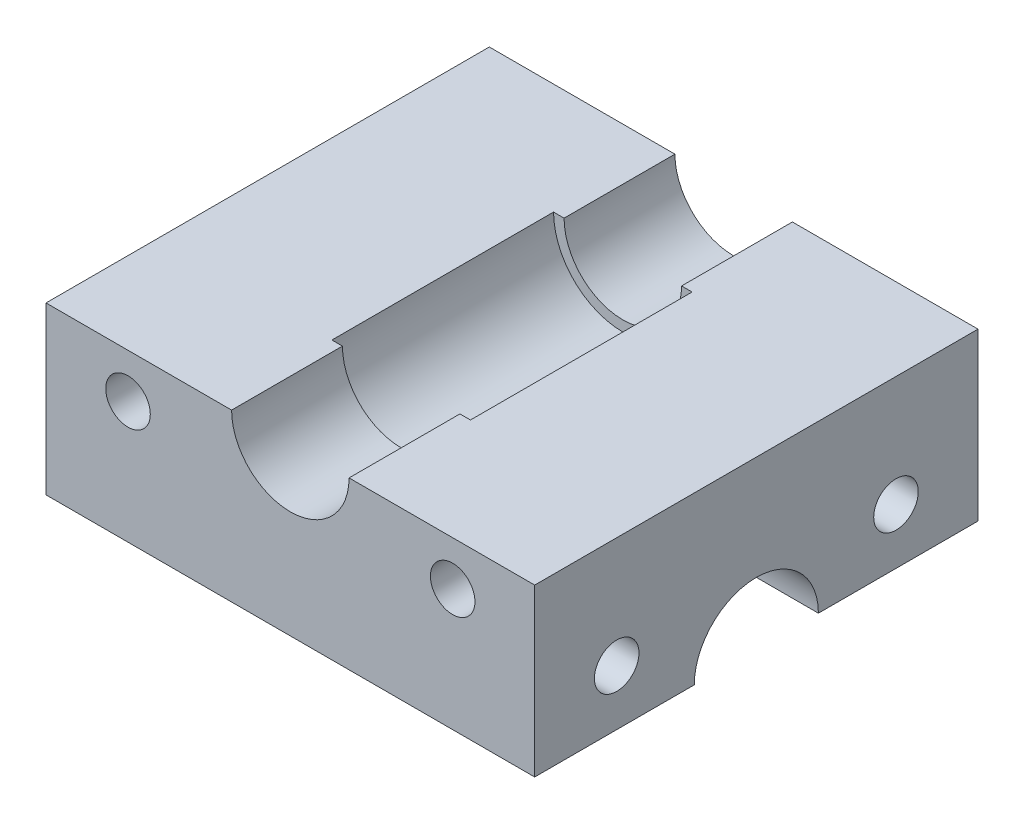
ISO-10303-21;
HEADER;
FILE_DESCRIPTION(('STEP AP214'),'2;1');
FILE_NAME('part.step','',(''),(''),'','','');
FILE_SCHEMA(('AUTOMOTIVE_DESIGN { 1 0 10303 214 1 1 1 1 }'));
ENDSEC;
DATA;
#1=APPLICATION_CONTEXT('core data for automotive mechanical design processes');
#2=APPLICATION_PROTOCOL_DEFINITION('international standard','automotive_design',2000,#1);
#3=PRODUCT_CONTEXT('',#1,'mechanical');
#4=PRODUCT('Part','Part','',(#3));
#5=PRODUCT_RELATED_PRODUCT_CATEGORY('part','',(#4));
#6=PRODUCT_DEFINITION_FORMATION('','',#4);
#7=PRODUCT_DEFINITION_CONTEXT('part definition',#1,'design');
#8=PRODUCT_DEFINITION('design','',#6,#7);
#9=PRODUCT_DEFINITION_SHAPE('','',#8);
#10=(LENGTH_UNIT() NAMED_UNIT(*) SI_UNIT(.MILLI.,.METRE.));
#11=(NAMED_UNIT(*) PLANE_ANGLE_UNIT() SI_UNIT($,.RADIAN.));
#12=(NAMED_UNIT(*) SI_UNIT($,.STERADIAN.) SOLID_ANGLE_UNIT());
#13=UNCERTAINTY_MEASURE_WITH_UNIT(LENGTH_MEASURE(1.E-05),#10,'distance_accuracy_value','');
#14=(GEOMETRIC_REPRESENTATION_CONTEXT(3) GLOBAL_UNCERTAINTY_ASSIGNED_CONTEXT((#13)) GLOBAL_UNIT_ASSIGNED_CONTEXT((#10,
#11,#12)) REPRESENTATION_CONTEXT('',''));
#15=CARTESIAN_POINT('',(0.,0.,0.));
#16=DIRECTION('',(0.,0.,1.));
#17=DIRECTION('',(1.,0.,0.));
#18=AXIS2_PLACEMENT_3D('',#15,#16,#17);
#19=CARTESIAN_POINT('',(-10.9940298507463,-2.47667711691045,50.8));
#20=DIRECTION('',(0.,1.,0.));
#21=DIRECTION('',(0.,0.,1.));
#22=AXIS2_PLACEMENT_3D('',#19,#20,#21);
#23=PLANE('',#22);
#24=DIRECTION('',(0.,0.,-1.));
#25=VECTOR('',#24,1.);
#26=CARTESIAN_POINT('',(-10.9940298507463,-2.47667711691045,50.8));
#27=LINE('',#26,#25);
#28=CARTESIAN_POINT('',(-10.9940298507463,-2.47667711691045,50.8));
#29=VERTEX_POINT('',#28);
#30=CARTESIAN_POINT('',(-10.9940298507463,-2.47667711691045,32.512));
#31=VERTEX_POINT('',#30);
#32=EDGE_CURVE('E135',#29,#31,#27,.T.);
#33=ORIENTED_EDGE('',*,*,#32,.T.);
#34=DIRECTION('',(1.,0.,0.));
#35=VECTOR('',#34,1.);
#36=CARTESIAN_POINT('',(-10.9940298507463,-2.47667711691045,32.512));
#37=LINE('',#36,#35);
#38=CARTESIAN_POINT('',(45.0059701492537,-2.47667711691045,32.512));
#39=VERTEX_POINT('',#38);
#40=EDGE_CURVE('E121',#31,#39,#37,.T.);
#41=ORIENTED_EDGE('',*,*,#40,.T.);
#42=DIRECTION('',(0.,0.,-1.));
#43=VECTOR('',#42,1.);
#44=CARTESIAN_POINT('',(45.0059701492537,-2.47667711691045,50.8));
#45=LINE('',#44,#43);
#46=CARTESIAN_POINT('',(45.0059701492537,-2.47667711691045,50.8));
#47=VERTEX_POINT('',#46);
#48=EDGE_CURVE('E145',#47,#39,#45,.T.);
#49=ORIENTED_EDGE('',*,*,#48,.F.);
#50=DIRECTION('',(1.,0.,0.));
#51=VECTOR('',#50,1.);
#52=CARTESIAN_POINT('',(-10.9940298507463,-2.47667711691045,50.8));
#53=LINE('',#52,#51);
#54=EDGE_CURVE('E139',#29,#47,#53,.T.);
#55=ORIENTED_EDGE('',*,*,#54,.F.);
#56=EDGE_LOOP('',(#33,#41,#49,#55));
#57=FACE_BOUND('',#56,.T.);
#58=ADVANCED_FACE('F35',(#57),#23,.F.);
#59=CARTESIAN_POINT('',(23.7369701492537,16.5733228830895,50.8));
#60=DIRECTION('',(0.,-1.,0.));
#61=DIRECTION('',(0.,0.,-1.));
#62=AXIS2_PLACEMENT_3D('',#59,#60,#61);
#63=PLANE('',#62);
#64=DIRECTION('',(-1.,0.,0.));
#65=VECTOR('',#64,1.);
#66=CARTESIAN_POINT('',(23.7369701492537,16.5733228830895,12.7));
#67=LINE('',#66,#65);
#68=CARTESIAN_POINT('',(24.9434701492537,16.5733228830895,12.7));
#69=VERTEX_POINT('',#68);
#70=CARTESIAN_POINT('',(23.7369701492537,16.5733228830895,12.7));
#71=VERTEX_POINT('',#70);
#72=EDGE_CURVE('E177',#69,#71,#67,.T.);
#73=ORIENTED_EDGE('',*,*,#72,.F.);
#74=DIRECTION('',(0.,0.,1.));
#75=VECTOR('',#74,1.);
#76=CARTESIAN_POINT('',(24.9434701492537,16.5733228830895,12.7));
#77=LINE('',#76,#75);
#78=CARTESIAN_POINT('',(24.9434701492537,16.5733228830895,38.1));
#79=VERTEX_POINT('',#78);
#80=EDGE_CURVE('E160',#69,#79,#77,.T.);
#81=ORIENTED_EDGE('',*,*,#80,.T.);
#82=DIRECTION('',(-1.,0.,0.));
#83=VECTOR('',#82,1.);
#84=CARTESIAN_POINT('',(23.7369701492537,16.5733228830895,38.1));
#85=LINE('',#84,#83);
#86=CARTESIAN_POINT('',(23.7369701492537,16.5733228830895,38.1));
#87=VERTEX_POINT('',#86);
#88=EDGE_CURVE('E166',#79,#87,#85,.T.);
#89=ORIENTED_EDGE('',*,*,#88,.T.);
#90=DIRECTION('',(0.,0.,-1.));
#91=VECTOR('',#90,1.);
#92=CARTESIAN_POINT('',(23.7369701492537,16.5733228830895,50.8));
#93=LINE('',#92,#91);
#94=CARTESIAN_POINT('',(23.7369701492537,16.5733228830895,50.8));
#95=VERTEX_POINT('',#94);
#96=EDGE_CURVE('E213',#95,#87,#93,.T.);
#97=ORIENTED_EDGE('',*,*,#96,.F.);
#98=DIRECTION('',(-1.,0.,0.));
#99=VECTOR('',#98,1.);
#100=CARTESIAN_POINT('',(23.7369701492537,16.5733228830895,50.8));
#101=LINE('',#100,#99);
#102=CARTESIAN_POINT('',(45.0059701492537,16.5733228830895,50.8));
#103=VERTEX_POINT('',#102);
#104=EDGE_CURVE('E187',#103,#95,#101,.T.);
#105=ORIENTED_EDGE('',*,*,#104,.F.);
#106=DIRECTION('',(0.,0.,-1.));
#107=VECTOR('',#106,1.);
#108=CARTESIAN_POINT('',(45.0059701492537,16.5733228830895,50.8));
#109=LINE('',#108,#107);
#110=CARTESIAN_POINT('',(45.0059701492537,16.5733228830895,0.));
#111=VERTEX_POINT('',#110);
#112=EDGE_CURVE('E215',#103,#111,#109,.T.);
#113=ORIENTED_EDGE('',*,*,#112,.T.);
#114=DIRECTION('',(-1.,0.,0.));
#115=VECTOR('',#114,1.);
#116=CARTESIAN_POINT('',(23.7369701492537,16.5733228830895,0.));
#117=LINE('',#116,#115);
#118=CARTESIAN_POINT('',(23.7369701492537,16.5733228830895,0.));
#119=VERTEX_POINT('',#118);
#120=EDGE_CURVE('E200',#111,#119,#117,.T.);
#121=ORIENTED_EDGE('',*,*,#120,.T.);
#122=EDGE_CURVE('E212',#71,#119,#93,.T.);
#123=ORIENTED_EDGE('',*,*,#122,.F.);
#124=EDGE_LOOP('',(#73,#81,#89,#97,#105,#113,#121,#123));
#125=FACE_BOUND('',#124,.T.);
#126=ADVANCED_FACE('F284',(#125),#63,.F.);
#127=CARTESIAN_POINT('',(17.0059701492537,16.5733228830895,50.8));
#128=DIRECTION('',(0.,0.,-1.));
#129=DIRECTION('',(-1.,0.,0.));
#130=AXIS2_PLACEMENT_3D('',#127,#128,#129);
#131=CYLINDRICAL_SURFACE('',#130,6.731);
#132=CARTESIAN_POINT('',(17.0059701492537,16.5733228830895,12.7));
#133=DIRECTION('',(0.,0.,1.));
#134=DIRECTION('',(1.,0.,0.));
#135=AXIS2_PLACEMENT_3D('',#132,#133,#134);
#136=CIRCLE('',#135,6.731);
#137=CARTESIAN_POINT('',(10.2749701492537,16.5733228830895,12.7));
#138=VERTEX_POINT('',#137);
#139=EDGE_CURVE('E175',#71,#138,#136,.F.);
#140=ORIENTED_EDGE('',*,*,#139,.F.);
#141=ORIENTED_EDGE('',*,*,#122,.T.);
#142=CARTESIAN_POINT('',(17.0059701492537,16.5733228830895,0.));
#143=DIRECTION('',(0.,0.,-1.));
#144=DIRECTION('',(-1.,0.,0.));
#145=AXIS2_PLACEMENT_3D('',#142,#143,#144);
#146=CIRCLE('',#145,6.731);
#147=CARTESIAN_POINT('',(10.2749701492537,16.5733228830895,0.));
#148=VERTEX_POINT('',#147);
#149=EDGE_CURVE('E203',#119,#148,#146,.T.);
#150=ORIENTED_EDGE('',*,*,#149,.T.);
#151=DIRECTION('',(0.,0.,-1.));
#152=VECTOR('',#151,1.);
#153=CARTESIAN_POINT('',(10.2749701492537,16.5733228830895,50.8));
#154=LINE('',#153,#152);
#155=EDGE_CURVE('E209',#138,#148,#154,.T.);
#156=ORIENTED_EDGE('',*,*,#155,.F.);
#157=EDGE_LOOP('',(#140,#141,#150,#156));
#158=FACE_BOUND('',#157,.T.);
#159=ADVANCED_FACE('F288',(#158),#131,.F.);
#160=CARTESIAN_POINT('',(-10.9940298507463,16.5733228830895,50.8));
#161=DIRECTION('',(0.,-1.,0.));
#162=DIRECTION('',(0.,0.,-1.));
#163=AXIS2_PLACEMENT_3D('',#160,#161,#162);
#164=PLANE('',#163);
#165=DIRECTION('',(-1.,0.,0.));
#166=VECTOR('',#165,1.);
#167=CARTESIAN_POINT('',(-10.9940298507463,16.5733228830895,12.7));
#168=LINE('',#167,#166);
#169=CARTESIAN_POINT('',(9.06847014925373,16.5733228830895,12.7));
#170=VERTEX_POINT('',#169);
#171=EDGE_CURVE('E11',#138,#170,#168,.T.);
#172=ORIENTED_EDGE('',*,*,#171,.F.);
#173=ORIENTED_EDGE('',*,*,#155,.T.);
#174=DIRECTION('',(-1.,0.,0.));
#175=VECTOR('',#174,1.);
#176=CARTESIAN_POINT('',(-10.9940298507463,16.5733228830895,0.));
#177=LINE('',#176,#175);
#178=CARTESIAN_POINT('',(-10.9940298507463,16.5733228830895,0.));
#179=VERTEX_POINT('',#178);
#180=EDGE_CURVE('E183',#148,#179,#177,.T.);
#181=ORIENTED_EDGE('',*,*,#180,.T.);
#182=DIRECTION('',(0.,0.,-1.));
#183=VECTOR('',#182,1.);
#184=CARTESIAN_POINT('',(-10.9940298507463,16.5733228830895,50.8));
#185=LINE('',#184,#183);
#186=CARTESIAN_POINT('',(-10.9940298507463,16.5733228830895,50.8));
#187=VERTEX_POINT('',#186);
#188=EDGE_CURVE('E193',#187,#179,#185,.T.);
#189=ORIENTED_EDGE('',*,*,#188,.F.);
#190=DIRECTION('',(-1.,0.,0.));
#191=VECTOR('',#190,1.);
#192=CARTESIAN_POINT('',(-10.9940298507463,16.5733228830895,50.8));
#193=LINE('',#192,#191);
#194=CARTESIAN_POINT('',(10.2749701492537,16.5733228830895,50.8));
#195=VERTEX_POINT('',#194);
#196=EDGE_CURVE('E191',#195,#187,#193,.T.);
#197=ORIENTED_EDGE('',*,*,#196,.F.);
#198=CARTESIAN_POINT('',(10.2749701492537,16.5733228830895,38.1));
#199=VERTEX_POINT('',#198);
#200=EDGE_CURVE('E210',#195,#199,#154,.T.);
#201=ORIENTED_EDGE('',*,*,#200,.T.);
#202=DIRECTION('',(-1.,0.,0.));
#203=VECTOR('',#202,1.);
#204=CARTESIAN_POINT('',(-10.9940298507463,16.5733228830895,38.1));
#205=LINE('',#204,#203);
#206=CARTESIAN_POINT('',(9.06847014925374,16.5733228830895,38.1));
#207=VERTEX_POINT('',#206);
#208=EDGE_CURVE('E141',#199,#207,#205,.T.);
#209=ORIENTED_EDGE('',*,*,#208,.T.);
#210=DIRECTION('',(0.,0.,1.));
#211=VECTOR('',#210,1.);
#212=CARTESIAN_POINT('',(9.06847014925373,16.5733228830895,12.7));
#213=LINE('',#212,#211);
#214=EDGE_CURVE('E43',#207,#170,#213,.F.);
#215=ORIENTED_EDGE('',*,*,#214,.T.);
#216=EDGE_LOOP('',(#172,#173,#181,#189,#197,#201,#209,#215));
#217=FACE_BOUND('',#216,.T.);
#218=ADVANCED_FACE('F151',(#217),#164,.F.);
#219=CARTESIAN_POINT('',(-10.9940298507463,-2.47667711691045,50.8));
#220=DIRECTION('',(1.,0.,0.));
#221=DIRECTION('',(0.,0.,-1.));
#222=AXIS2_PLACEMENT_3D('',#219,#220,#221);
#223=PLANE('',#222);
#224=CARTESIAN_POINT('',(-10.9940298507463,3.87332288308955,41.402));
#225=DIRECTION('',(-1.,0.,0.));
#226=DIRECTION('',(0.,0.,1.));
#227=AXIS2_PLACEMENT_3D('',#224,#225,#226);
#228=CIRCLE('',#227,2.55269999999999);
#229=CARTESIAN_POINT('',(-10.9940298507463,3.87332288308955,43.9547));
#230=VERTEX_POINT('',#229);
#231=EDGE_CURVE('E240',#230,#230,#228,.T.);
#232=ORIENTED_EDGE('',*,*,#231,.F.);
#233=EDGE_LOOP('',(#232));
#234=FACE_BOUND('',#233,.T.);
#235=CARTESIAN_POINT('',(-10.9940298507463,3.87332288308955,9.398));
#236=DIRECTION('',(-1.,0.,0.));
#237=DIRECTION('',(0.,0.,1.));
#238=AXIS2_PLACEMENT_3D('',#235,#236,#237);
#239=CIRCLE('',#238,2.55269999999999);
#240=CARTESIAN_POINT('',(-10.9940298507463,3.87332288308955,11.9507));
#241=VERTEX_POINT('',#240);
#242=EDGE_CURVE('E260',#241,#241,#239,.T.);
#243=ORIENTED_EDGE('',*,*,#242,.F.);
#244=EDGE_LOOP('',(#243));
#245=FACE_BOUND('',#244,.T.);
#246=CARTESIAN_POINT('',(-10.9940298507463,-2.47667711691045,18.288));
#247=VERTEX_POINT('',#246);
#248=CARTESIAN_POINT('',(-10.9940298507463,-2.47667711691045,0.));
#249=VERTEX_POINT('',#248);
#250=EDGE_CURVE('E137',#247,#249,#27,.T.);
#251=ORIENTED_EDGE('',*,*,#250,.F.);
#252=CARTESIAN_POINT('',(-10.9940298507463,-2.47667711691045,25.4));
#253=DIRECTION('',(1.,0.,0.));
#254=DIRECTION('',(0.,0.,-1.));
#255=AXIS2_PLACEMENT_3D('',#252,#253,#254);
#256=CIRCLE('',#255,7.112);
#257=EDGE_CURVE('E124',#247,#31,#256,.T.);
#258=ORIENTED_EDGE('',*,*,#257,.T.);
#259=ORIENTED_EDGE('',*,*,#32,.F.);
#260=DIRECTION('',(0.,-1.,0.));
#261=VECTOR('',#260,1.);
#262=CARTESIAN_POINT('',(-10.9940298507463,-2.47667711691045,50.8));
#263=LINE('',#262,#261);
#264=EDGE_CURVE('E181',#187,#29,#263,.T.);
#265=ORIENTED_EDGE('',*,*,#264,.F.);
#266=ORIENTED_EDGE('',*,*,#188,.T.);
#267=DIRECTION('',(0.,-1.,0.));
#268=VECTOR('',#267,1.);
#269=CARTESIAN_POINT('',(-10.9940298507463,-2.47667711691045,0.));
#270=LINE('',#269,#268);
#271=EDGE_CURVE('E180',#179,#249,#270,.T.);
#272=ORIENTED_EDGE('',*,*,#271,.T.);
#273=EDGE_LOOP('',(#251,#258,#259,#265,#266,#272));
#274=FACE_BOUND('',#273,.T.);
#275=ADVANCED_FACE('F37',(#234,#245,#274),#223,.F.);
#276=CARTESIAN_POINT('',(45.0059701492537,-2.47667711691045,18.288));
#277=VERTEX_POINT('',#276);
#278=CARTESIAN_POINT('',(45.0059701492537,-2.47667711691045,0.));
#279=VERTEX_POINT('',#278);
#280=EDGE_CURVE('E217',#277,#279,#45,.T.);
#281=ORIENTED_EDGE('',*,*,#280,.F.);
#282=DIRECTION('',(1.,0.,0.));
#283=VECTOR('',#282,1.);
#284=CARTESIAN_POINT('',(-10.9940298507463,-2.47667711691045,18.288));
#285=LINE('',#284,#283);
#286=EDGE_CURVE('E50',#247,#277,#285,.T.);
#287=ORIENTED_EDGE('',*,*,#286,.F.);
#288=ORIENTED_EDGE('',*,*,#250,.T.);
#289=DIRECTION('',(1.,0.,0.));
#290=VECTOR('',#289,1.);
#291=CARTESIAN_POINT('',(-10.9940298507463,-2.47667711691045,0.));
#292=LINE('',#291,#290);
#293=EDGE_CURVE('E195',#249,#279,#292,.T.);
#294=ORIENTED_EDGE('',*,*,#293,.T.);
#295=EDGE_LOOP('',(#281,#287,#288,#294));
#296=FACE_BOUND('',#295,.T.);
#297=ADVANCED_FACE('F239',(#296),#23,.F.);
#298=CARTESIAN_POINT('',(45.0059701492537,-2.47667711691045,50.8));
#299=DIRECTION('',(-1.,0.,0.));
#300=DIRECTION('',(0.,0.,1.));
#301=AXIS2_PLACEMENT_3D('',#298,#299,#300);
#302=PLANE('',#301);
#303=CARTESIAN_POINT('',(45.0059701492537,3.87332288308955,41.402));
#304=DIRECTION('',(-1.,0.,0.));
#305=DIRECTION('',(0.,0.,1.));
#306=AXIS2_PLACEMENT_3D('',#303,#304,#305);
#307=CIRCLE('',#306,2.55269999999999);
#308=CARTESIAN_POINT('',(45.0059701492537,3.87332288308955,43.9547));
#309=VERTEX_POINT('',#308);
#310=EDGE_CURVE('E243',#309,#309,#307,.T.);
#311=ORIENTED_EDGE('',*,*,#310,.T.);
#312=EDGE_LOOP('',(#311));
#313=FACE_BOUND('',#312,.T.);
#314=CARTESIAN_POINT('',(45.0059701492537,3.87332288308955,9.398));
#315=DIRECTION('',(-1.,0.,0.));
#316=DIRECTION('',(0.,0.,1.));
#317=AXIS2_PLACEMENT_3D('',#314,#315,#316);
#318=CIRCLE('',#317,2.55269999999999);
#319=CARTESIAN_POINT('',(45.0059701492537,3.87332288308955,11.9507));
#320=VERTEX_POINT('',#319);
#321=EDGE_CURVE('E168',#320,#320,#318,.T.);
#322=ORIENTED_EDGE('',*,*,#321,.T.);
#323=EDGE_LOOP('',(#322));
#324=FACE_BOUND('',#323,.T.);
#325=ORIENTED_EDGE('',*,*,#48,.T.);
#326=CARTESIAN_POINT('',(45.0059701492537,-2.47667711691045,25.4));
#327=DIRECTION('',(1.,0.,0.));
#328=DIRECTION('',(0.,0.,-1.));
#329=AXIS2_PLACEMENT_3D('',#326,#327,#328);
#330=CIRCLE('',#329,7.112);
#331=EDGE_CURVE('E125',#277,#39,#330,.T.);
#332=ORIENTED_EDGE('',*,*,#331,.F.);
#333=ORIENTED_EDGE('',*,*,#280,.T.);
#334=DIRECTION('',(0.,1.,0.));
#335=VECTOR('',#334,1.);
#336=CARTESIAN_POINT('',(45.0059701492537,-2.47667711691045,0.));
#337=LINE('',#336,#335);
#338=EDGE_CURVE('E198',#279,#111,#337,.T.);
#339=ORIENTED_EDGE('',*,*,#338,.T.);
#340=ORIENTED_EDGE('',*,*,#112,.F.);
#341=DIRECTION('',(0.,1.,0.));
#342=VECTOR('',#341,1.);
#343=CARTESIAN_POINT('',(45.0059701492537,-2.47667711691045,50.8));
#344=LINE('',#343,#342);
#345=EDGE_CURVE('E185',#47,#103,#344,.T.);
#346=ORIENTED_EDGE('',*,*,#345,.F.);
#347=EDGE_LOOP('',(#325,#332,#333,#339,#340,#346));
#348=FACE_BOUND('',#347,.T.);
#349=ADVANCED_FACE('F225',(#313,#324,#348),#302,.F.);
#350=ORIENTED_EDGE('',*,*,#96,.T.);
#351=CARTESIAN_POINT('',(17.0059701492537,16.5733228830895,38.1));
#352=DIRECTION('',(0.,0.,1.));
#353=DIRECTION('',(1.,0.,0.));
#354=AXIS2_PLACEMENT_3D('',#351,#352,#353);
#355=CIRCLE('',#354,6.731);
#356=EDGE_CURVE('E163',#87,#199,#355,.F.);
#357=ORIENTED_EDGE('',*,*,#356,.T.);
#358=ORIENTED_EDGE('',*,*,#200,.F.);
#359=CARTESIAN_POINT('',(17.0059701492537,16.5733228830895,50.8));
#360=DIRECTION('',(0.,0.,-1.));
#361=DIRECTION('',(-1.,0.,0.));
#362=AXIS2_PLACEMENT_3D('',#359,#360,#361);
#363=CIRCLE('',#362,6.731);
#364=EDGE_CURVE('E189',#95,#195,#363,.T.);
#365=ORIENTED_EDGE('',*,*,#364,.F.);
#366=EDGE_LOOP('',(#350,#357,#358,#365));
#367=FACE_BOUND('',#366,.T.);
#368=ADVANCED_FACE('F296',(#367),#131,.F.);
#369=CARTESIAN_POINT('',(17.0059701492537,16.5733228830895,50.8));
#370=DIRECTION('',(0.,0.,-1.));
#371=DIRECTION('',(-1.,0.,0.));
#372=AXIS2_PLACEMENT_3D('',#369,#370,#371);
#373=PLANE('',#372);
#374=CARTESIAN_POINT('',(-1.59602985074627,11.4933228830896,50.8));
#375=DIRECTION('',(0.,0.,1.));
#376=DIRECTION('',(1.,0.,0.));
#377=AXIS2_PLACEMENT_3D('',#374,#375,#376);
#378=CIRCLE('',#377,2.55269999999999);
#379=CARTESIAN_POINT('',(0.95667014925372,11.4933228830896,50.8));
#380=VERTEX_POINT('',#379);
#381=EDGE_CURVE('E249',#380,#380,#378,.T.);
#382=ORIENTED_EDGE('',*,*,#381,.F.);
#383=EDGE_LOOP('',(#382));
#384=FACE_BOUND('',#383,.T.);
#385=CARTESIAN_POINT('',(35.6079701492537,11.4933228830896,50.8));
#386=DIRECTION('',(0.,0.,1.));
#387=DIRECTION('',(1.,0.,0.));
#388=AXIS2_PLACEMENT_3D('',#385,#386,#387);
#389=CIRCLE('',#388,2.55269999999999);
#390=CARTESIAN_POINT('',(38.1606701492537,11.4933228830896,50.8));
#391=VERTEX_POINT('',#390);
#392=EDGE_CURVE('E255',#391,#391,#389,.T.);
#393=ORIENTED_EDGE('',*,*,#392,.F.);
#394=EDGE_LOOP('',(#393));
#395=FACE_BOUND('',#394,.T.);
#396=ORIENTED_EDGE('',*,*,#264,.T.);
#397=ORIENTED_EDGE('',*,*,#54,.T.);
#398=ORIENTED_EDGE('',*,*,#345,.T.);
#399=ORIENTED_EDGE('',*,*,#104,.T.);
#400=ORIENTED_EDGE('',*,*,#364,.T.);
#401=ORIENTED_EDGE('',*,*,#196,.T.);
#402=EDGE_LOOP('',(#396,#397,#398,#399,#400,#401));
#403=FACE_BOUND('',#402,.T.);
#404=ADVANCED_FACE('F227',(#384,#395,#403),#373,.F.);
#405=CARTESIAN_POINT('',(17.0059701492537,16.5733228830895,0.));
#406=DIRECTION('',(0.,0.,-1.));
#407=DIRECTION('',(-1.,0.,0.));
#408=AXIS2_PLACEMENT_3D('',#405,#406,#407);
#409=PLANE('',#408);
#410=CARTESIAN_POINT('',(-1.59602985074627,11.4933228830896,0.));
#411=DIRECTION('',(0.,0.,1.));
#412=DIRECTION('',(1.,0.,0.));
#413=AXIS2_PLACEMENT_3D('',#410,#411,#412);
#414=CIRCLE('',#413,2.55269999999999);
#415=CARTESIAN_POINT('',(0.95667014925372,11.4933228830896,0.));
#416=VERTEX_POINT('',#415);
#417=EDGE_CURVE('E252',#416,#416,#414,.T.);
#418=ORIENTED_EDGE('',*,*,#417,.T.);
#419=EDGE_LOOP('',(#418));
#420=FACE_BOUND('',#419,.T.);
#421=CARTESIAN_POINT('',(35.6079701492537,11.4933228830896,0.));
#422=DIRECTION('',(0.,0.,1.));
#423=DIRECTION('',(1.,0.,0.));
#424=AXIS2_PLACEMENT_3D('',#421,#422,#423);
#425=CIRCLE('',#424,2.55269999999998);
#426=CARTESIAN_POINT('',(38.1606701492537,11.4933228830896,0.));
#427=VERTEX_POINT('',#426);
#428=EDGE_CURVE('E258',#427,#427,#425,.T.);
#429=ORIENTED_EDGE('',*,*,#428,.T.);
#430=EDGE_LOOP('',(#429));
#431=FACE_BOUND('',#430,.T.);
#432=ORIENTED_EDGE('',*,*,#271,.F.);
#433=ORIENTED_EDGE('',*,*,#180,.F.);
#434=ORIENTED_EDGE('',*,*,#149,.F.);
#435=ORIENTED_EDGE('',*,*,#120,.F.);
#436=ORIENTED_EDGE('',*,*,#338,.F.);
#437=ORIENTED_EDGE('',*,*,#293,.F.);
#438=EDGE_LOOP('',(#432,#433,#434,#435,#436,#437));
#439=FACE_BOUND('',#438,.T.);
#440=ADVANCED_FACE('F235',(#420,#431,#439),#409,.T.);
#441=CARTESIAN_POINT('',(17.0059701492537,16.5733228830895,12.7));
#442=DIRECTION('',(0.,0.,1.));
#443=DIRECTION('',(1.,0.,0.));
#444=AXIS2_PLACEMENT_3D('',#441,#442,#443);
#445=CYLINDRICAL_SURFACE('',#444,7.9375);
#446=CARTESIAN_POINT('',(17.0059701492537,16.5733228830895,12.7));
#447=DIRECTION('',(0.,0.,1.));
#448=DIRECTION('',(1.,0.,0.));
#449=AXIS2_PLACEMENT_3D('',#446,#447,#448);
#450=CIRCLE('',#449,7.9375);
#451=EDGE_CURVE('E159',#170,#69,#450,.T.);
#452=ORIENTED_EDGE('',*,*,#451,.F.);
#453=ORIENTED_EDGE('',*,*,#214,.F.);
#454=CARTESIAN_POINT('',(17.0059701492537,16.5733228830895,38.1));
#455=DIRECTION('',(0.,0.,1.));
#456=DIRECTION('',(1.,0.,0.));
#457=AXIS2_PLACEMENT_3D('',#454,#455,#456);
#458=CIRCLE('',#457,7.9375);
#459=EDGE_CURVE('E58',#207,#79,#458,.T.);
#460=ORIENTED_EDGE('',*,*,#459,.T.);
#461=ORIENTED_EDGE('',*,*,#80,.F.);
#462=EDGE_LOOP('',(#452,#453,#460,#461));
#463=FACE_BOUND('',#462,.T.);
#464=ADVANCED_FACE('F156',(#463),#445,.F.);
#465=CARTESIAN_POINT('',(17.0059701492537,16.5733228830895,12.7));
#466=DIRECTION('',(0.,0.,1.));
#467=DIRECTION('',(1.,0.,0.));
#468=AXIS2_PLACEMENT_3D('',#465,#466,#467);
#469=PLANE('',#468);
#470=ORIENTED_EDGE('',*,*,#72,.T.);
#471=ORIENTED_EDGE('',*,*,#139,.T.);
#472=ORIENTED_EDGE('',*,*,#171,.T.);
#473=ORIENTED_EDGE('',*,*,#451,.T.);
#474=EDGE_LOOP('',(#470,#471,#472,#473));
#475=FACE_BOUND('',#474,.T.);
#476=ADVANCED_FACE('F280',(#475),#469,.T.);
#477=CARTESIAN_POINT('',(17.0059701492537,16.5733228830895,38.1));
#478=DIRECTION('',(0.,0.,1.));
#479=DIRECTION('',(1.,0.,0.));
#480=AXIS2_PLACEMENT_3D('',#477,#478,#479);
#481=PLANE('',#480);
#482=ORIENTED_EDGE('',*,*,#459,.F.);
#483=ORIENTED_EDGE('',*,*,#208,.F.);
#484=ORIENTED_EDGE('',*,*,#356,.F.);
#485=ORIENTED_EDGE('',*,*,#88,.F.);
#486=EDGE_LOOP('',(#482,#483,#484,#485));
#487=FACE_BOUND('',#486,.T.);
#488=ADVANCED_FACE('F271',(#487),#481,.F.);
#489=CARTESIAN_POINT('',(-10.9940298507463,3.87332288308955,9.398));
#490=DIRECTION('',(-1.,0.,0.));
#491=DIRECTION('',(0.,0.,1.));
#492=AXIS2_PLACEMENT_3D('',#489,#490,#491);
#493=CYLINDRICAL_SURFACE('',#492,2.55269999999999);
#494=ORIENTED_EDGE('',*,*,#321,.F.);
#495=EDGE_LOOP('',(#494));
#496=FACE_BOUND('',#495,.T.);
#497=ORIENTED_EDGE('',*,*,#242,.T.);
#498=EDGE_LOOP('',(#497));
#499=FACE_BOUND('',#498,.T.);
#500=ADVANCED_FACE('F268',(#496,#499),#493,.F.);
#501=CARTESIAN_POINT('',(35.6079701492537,11.4933228830896,50.8));
#502=DIRECTION('',(0.,0.,1.));
#503=DIRECTION('',(1.,0.,0.));
#504=AXIS2_PLACEMENT_3D('',#501,#502,#503);
#505=CYLINDRICAL_SURFACE('',#504,2.55269999999999);
#506=ORIENTED_EDGE('',*,*,#428,.F.);
#507=EDGE_LOOP('',(#506));
#508=FACE_BOUND('',#507,.T.);
#509=ORIENTED_EDGE('',*,*,#392,.T.);
#510=EDGE_LOOP('',(#509));
#511=FACE_BOUND('',#510,.T.);
#512=ADVANCED_FACE('F270',(#508,#511),#505,.F.);
#513=CARTESIAN_POINT('',(-1.59602985074627,11.4933228830896,50.8));
#514=DIRECTION('',(0.,0.,1.));
#515=DIRECTION('',(1.,0.,0.));
#516=AXIS2_PLACEMENT_3D('',#513,#514,#515);
#517=CYLINDRICAL_SURFACE('',#516,2.55269999999999);
#518=ORIENTED_EDGE('',*,*,#417,.F.);
#519=EDGE_LOOP('',(#518));
#520=FACE_BOUND('',#519,.T.);
#521=ORIENTED_EDGE('',*,*,#381,.T.);
#522=EDGE_LOOP('',(#521));
#523=FACE_BOUND('',#522,.T.);
#524=ADVANCED_FACE('F277',(#520,#523),#517,.F.);
#525=CARTESIAN_POINT('',(-10.9940298507463,3.87332288308955,41.402));
#526=DIRECTION('',(-1.,0.,0.));
#527=DIRECTION('',(0.,0.,1.));
#528=AXIS2_PLACEMENT_3D('',#525,#526,#527);
#529=CYLINDRICAL_SURFACE('',#528,2.55269999999999);
#530=ORIENTED_EDGE('',*,*,#310,.F.);
#531=EDGE_LOOP('',(#530));
#532=FACE_BOUND('',#531,.T.);
#533=ORIENTED_EDGE('',*,*,#231,.T.);
#534=EDGE_LOOP('',(#533));
#535=FACE_BOUND('',#534,.T.);
#536=ADVANCED_FACE('F306',(#532,#535),#529,.F.);
#537=CARTESIAN_POINT('',(-10.9940298507463,-2.47667711691045,25.4));
#538=DIRECTION('',(1.,0.,0.));
#539=DIRECTION('',(0.,0.,-1.));
#540=AXIS2_PLACEMENT_3D('',#537,#538,#539);
#541=CYLINDRICAL_SURFACE('',#540,7.112);
#542=ORIENTED_EDGE('',*,*,#331,.T.);
#543=ORIENTED_EDGE('',*,*,#40,.F.);
#544=ORIENTED_EDGE('',*,*,#257,.F.);
#545=ORIENTED_EDGE('',*,*,#286,.T.);
#546=EDGE_LOOP('',(#542,#543,#544,#545));
#547=FACE_BOUND('',#546,.T.);
#548=ADVANCED_FACE('F123',(#547),#541,.F.);
#549=CLOSED_SHELL('',(#58,#126,#159,#218,#275,#297,#349,#368,#404,#440,#464,#476,#488,#500,#512,
#524,#536,#548));
#550=MANIFOLD_SOLID_BREP('B2',#549);
#551=ADVANCED_BREP_SHAPE_REPRESENTATION('',(#18,#550),#14);
#552=SHAPE_DEFINITION_REPRESENTATION(#9,#551);
ENDSEC;
END-ISO-10303-21;
